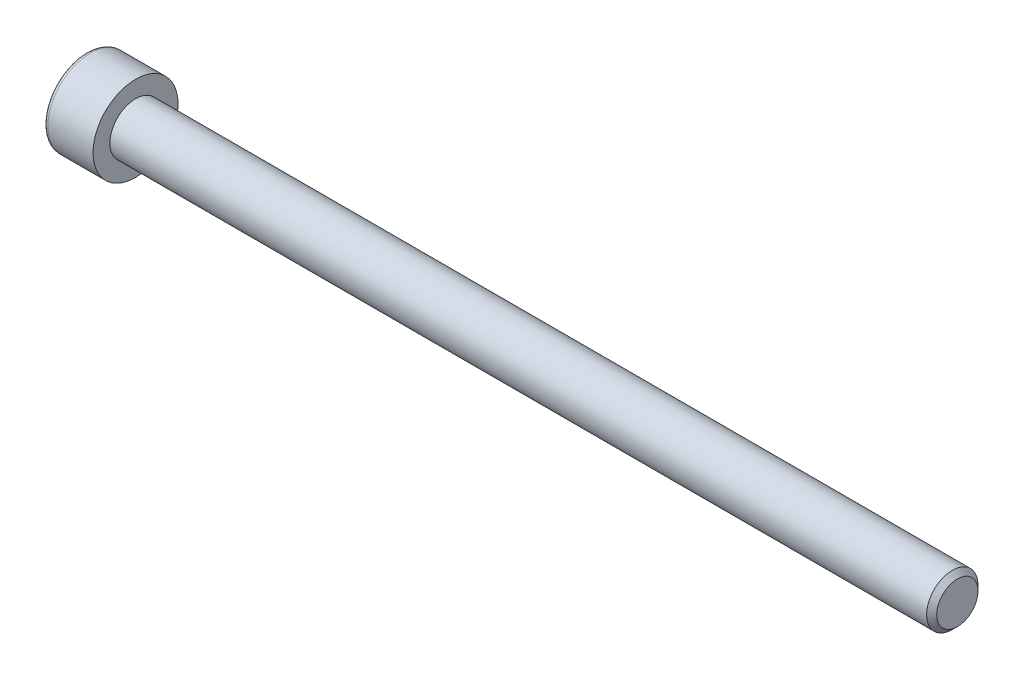
ISO-10303-21;
HEADER;
FILE_DESCRIPTION(('STEP AP214'),'2;1');
FILE_NAME('part.step','',(''),(''),'','','');
FILE_SCHEMA(('AUTOMOTIVE_DESIGN { 1 0 10303 214 1 1 1 1 }'));
ENDSEC;
DATA;
#1=APPLICATION_CONTEXT('core data for automotive mechanical design processes');
#2=APPLICATION_PROTOCOL_DEFINITION('international standard','automotive_design',2000,#1);
#3=PRODUCT_CONTEXT('',#1,'mechanical');
#4=PRODUCT('Part','Part','',(#3));
#5=PRODUCT_RELATED_PRODUCT_CATEGORY('part','',(#4));
#6=PRODUCT_DEFINITION_FORMATION('','',#4);
#7=PRODUCT_DEFINITION_CONTEXT('part definition',#1,'design');
#8=PRODUCT_DEFINITION('design','',#6,#7);
#9=PRODUCT_DEFINITION_SHAPE('','',#8);
#10=(LENGTH_UNIT() NAMED_UNIT(*) SI_UNIT(.MILLI.,.METRE.));
#11=(NAMED_UNIT(*) PLANE_ANGLE_UNIT() SI_UNIT($,.RADIAN.));
#12=(NAMED_UNIT(*) SI_UNIT($,.STERADIAN.) SOLID_ANGLE_UNIT());
#13=UNCERTAINTY_MEASURE_WITH_UNIT(LENGTH_MEASURE(1.E-05),#10,'distance_accuracy_value','');
#14=(GEOMETRIC_REPRESENTATION_CONTEXT(3) GLOBAL_UNCERTAINTY_ASSIGNED_CONTEXT((#13)) GLOBAL_UNIT_ASSIGNED_CONTEXT((#10,
#11,#12)) REPRESENTATION_CONTEXT('',''));
#15=CARTESIAN_POINT('',(0.,0.,0.));
#16=DIRECTION('',(0.,0.,1.));
#17=DIRECTION('',(1.,0.,0.));
#18=AXIS2_PLACEMENT_3D('',#15,#16,#17);
#19=CARTESIAN_POINT('',(0.,0.,0.));
#20=DIRECTION('',(-1.,0.,0.));
#21=DIRECTION('',(0.,0.,1.));
#22=AXIS2_PLACEMENT_3D('',#19,#20,#21);
#23=PLANE('',#22);
#24=CARTESIAN_POINT('',(0.,0.,0.));
#25=DIRECTION('',(-1.,0.,0.));
#26=DIRECTION('',(0.,0.,1.));
#27=AXIS2_PLACEMENT_3D('',#24,#25,#26);
#28=CIRCLE('',#27,4.14);
#29=CARTESIAN_POINT('',(0.,0.,4.14));
#30=VERTEX_POINT('',#29);
#31=EDGE_CURVE('E108',#30,#30,#28,.T.);
#32=ORIENTED_EDGE('',*,*,#31,.F.);
#33=EDGE_LOOP('',(#32));
#34=FACE_BOUND('',#33,.T.);
#35=CARTESIAN_POINT('',(0.,0.,0.));
#36=DIRECTION('',(-1.,0.,0.));
#37=DIRECTION('',(0.,0.,1.));
#38=AXIS2_PLACEMENT_3D('',#35,#36,#37);
#39=CIRCLE('',#38,2.5);
#40=CARTESIAN_POINT('',(0.,0.,2.5));
#41=VERTEX_POINT('',#40);
#42=EDGE_CURVE('E11',#41,#41,#39,.F.);
#43=ORIENTED_EDGE('',*,*,#42,.F.);
#44=EDGE_LOOP('',(#43));
#45=FACE_BOUND('',#44,.T.);
#46=ADVANCED_FACE('F16',(#34,#45),#23,.F.);
#47=CARTESIAN_POINT('',(-4.82,3.726,0.));
#48=DIRECTION('',(1.,0.,0.));
#49=DIRECTION('',(0.,0.,-1.));
#50=AXIS2_PLACEMENT_3D('',#47,#48,#49);
#51=PLANE('',#50);
#52=CARTESIAN_POINT('',(-4.82,0.,0.));
#53=DIRECTION('',(-1.,0.,0.));
#54=DIRECTION('',(0.,0.,1.));
#55=AXIS2_PLACEMENT_3D('',#52,#53,#54);
#56=CIRCLE('',#55,3.726);
#57=CARTESIAN_POINT('',(-4.82,0.,3.726));
#58=VERTEX_POINT('',#57);
#59=EDGE_CURVE('E91',#58,#58,#56,.T.);
#60=ORIENTED_EDGE('',*,*,#59,.T.);
#61=EDGE_LOOP('',(#60));
#62=FACE_BOUND('',#61,.T.);
#63=DIRECTION('',(0.,0.5,0.866025403784438));
#64=VECTOR('',#63,1.);
#65=CARTESIAN_POINT('',(-4.82,-0.800550807568874,2.61340532725041));
#66=LINE('',#65,#64);
#67=CARTESIAN_POINT('',(-4.82,-2.30940107675851,0.));
#68=VERTEX_POINT('',#67);
#69=CARTESIAN_POINT('',(-4.82,-1.15470053837925,2.));
#70=VERTEX_POINT('',#69);
#71=EDGE_CURVE('E25',#68,#70,#66,.T.);
#72=ORIENTED_EDGE('',*,*,#71,.F.);
#73=DIRECTION('',(0.,-0.5,0.866025403784439));
#74=VECTOR('',#73,1.);
#75=CARTESIAN_POINT('',(-4.82,-0.800550807568879,-2.61340532725041));
#76=LINE('',#75,#74);
#77=CARTESIAN_POINT('',(-4.82,-1.15470053837925,-2.));
#78=VERTEX_POINT('',#77);
#79=EDGE_CURVE('E40',#78,#68,#76,.T.);
#80=ORIENTED_EDGE('',*,*,#79,.F.);
#81=DIRECTION('',(0.,-1.,0.));
#82=VECTOR('',#81,1.);
#83=CARTESIAN_POINT('',(-4.82,3.726,-2.));
#84=LINE('',#83,#82);
#85=CARTESIAN_POINT('',(-4.82,1.15470053837925,-2.));
#86=VERTEX_POINT('',#85);
#87=EDGE_CURVE('E121',#86,#78,#84,.T.);
#88=ORIENTED_EDGE('',*,*,#87,.F.);
#89=DIRECTION('',(0.,-0.5,-0.866025403784439));
#90=VECTOR('',#89,1.);
#91=CARTESIAN_POINT('',(-4.82,2.66355080756888,0.613405327250409));
#92=LINE('',#91,#90);
#93=CARTESIAN_POINT('',(-4.82,2.30940107675851,0.));
#94=VERTEX_POINT('',#93);
#95=EDGE_CURVE('E118',#94,#86,#92,.T.);
#96=ORIENTED_EDGE('',*,*,#95,.F.);
#97=DIRECTION('',(0.,0.5,-0.866025403784439));
#98=VECTOR('',#97,1.);
#99=CARTESIAN_POINT('',(-4.82,2.66355080756888,-0.613405327250409));
#100=LINE('',#99,#98);
#101=CARTESIAN_POINT('',(-4.82,1.15470053837925,2.));
#102=VERTEX_POINT('',#101);
#103=EDGE_CURVE('E115',#102,#94,#100,.T.);
#104=ORIENTED_EDGE('',*,*,#103,.F.);
#105=DIRECTION('',(0.,1.,0.));
#106=VECTOR('',#105,1.);
#107=CARTESIAN_POINT('',(-4.82,3.726,2.));
#108=LINE('',#107,#106);
#109=EDGE_CURVE('E112',#70,#102,#108,.T.);
#110=ORIENTED_EDGE('',*,*,#109,.F.);
#111=EDGE_LOOP('',(#72,#80,#88,#96,#104,#110));
#112=FACE_BOUND('',#111,.T.);
#113=ADVANCED_FACE('F18',(#62,#112),#51,.F.);
#114=CARTESIAN_POINT('',(-4.82,0.,0.));
#115=DIRECTION('',(-1.,0.,0.));
#116=DIRECTION('',(0.,0.,1.));
#117=AXIS2_PLACEMENT_3D('',#114,#115,#116);
#118=CYLINDRICAL_SURFACE('',#117,4.14);
#119=CARTESIAN_POINT('',(-4.406,0.,0.));
#120=DIRECTION('',(-1.,0.,0.));
#121=DIRECTION('',(0.,0.,1.));
#122=AXIS2_PLACEMENT_3D('',#119,#120,#121);
#123=CIRCLE('',#122,4.14);
#124=CARTESIAN_POINT('',(-4.406,0.,4.14));
#125=VERTEX_POINT('',#124);
#126=EDGE_CURVE('E98',#125,#125,#123,.T.);
#127=ORIENTED_EDGE('',*,*,#126,.F.);
#128=EDGE_LOOP('',(#127));
#129=FACE_BOUND('',#128,.T.);
#130=ORIENTED_EDGE('',*,*,#31,.T.);
#131=EDGE_LOOP('',(#130));
#132=FACE_BOUND('',#131,.T.);
#133=ADVANCED_FACE('F202',(#129,#132),#118,.T.);
#134=CARTESIAN_POINT('',(-4.406,0.,0.));
#135=DIRECTION('',(-1.,0.,0.));
#136=DIRECTION('',(0.,0.,1.));
#137=AXIS2_PLACEMENT_3D('',#134,#135,#136);
#138=TOROIDAL_SURFACE('',#137,3.726,0.414);
#139=ORIENTED_EDGE('',*,*,#59,.F.);
#140=EDGE_LOOP('',(#139));
#141=FACE_BOUND('',#140,.T.);
#142=ORIENTED_EDGE('',*,*,#126,.T.);
#143=EDGE_LOOP('',(#142));
#144=FACE_BOUND('',#143,.T.);
#145=ADVANCED_FACE('F209',(#141,#144),#138,.T.);
#146=CARTESIAN_POINT('',(-2.32,-1.15470053837925,2.));
#147=DIRECTION('',(0.,0.866025403784438,-0.5));
#148=DIRECTION('',(0.,0.5,0.866025403784438));
#149=AXIS2_PLACEMENT_3D('',#146,#147,#148);
#150=PLANE('',#149);
#151=ORIENTED_EDGE('',*,*,#71,.T.);
#152=DIRECTION('',(-1.,0.,0.));
#153=VECTOR('',#152,1.);
#154=CARTESIAN_POINT('',(-2.32,-1.15470053837925,2.));
#155=LINE('',#154,#153);
#156=CARTESIAN_POINT('',(-2.32,-1.15470053837925,2.));
#157=VERTEX_POINT('',#156);
#158=EDGE_CURVE('E32',#157,#70,#155,.T.);
#159=ORIENTED_EDGE('',*,*,#158,.F.);
#160=DIRECTION('',(0.,-0.5,-0.866025403784439));
#161=VECTOR('',#160,1.);
#162=CARTESIAN_POINT('',(-2.32,-1.15470053837925,2.));
#163=LINE('',#162,#161);
#164=CARTESIAN_POINT('',(-2.32,-2.30940107675851,0.));
#165=VERTEX_POINT('',#164);
#166=EDGE_CURVE('E76',#157,#165,#163,.T.);
#167=ORIENTED_EDGE('',*,*,#166,.T.);
#168=DIRECTION('',(-1.,0.,0.));
#169=VECTOR('',#168,1.);
#170=CARTESIAN_POINT('',(-2.32,-2.30940107675851,0.));
#171=LINE('',#170,#169);
#172=EDGE_CURVE('E84',#165,#68,#171,.T.);
#173=ORIENTED_EDGE('',*,*,#172,.T.);
#174=EDGE_LOOP('',(#151,#159,#167,#173));
#175=FACE_BOUND('',#174,.T.);
#176=ADVANCED_FACE('F83',(#175),#150,.T.);
#177=CARTESIAN_POINT('',(-2.32,-2.30940107675851,0.));
#178=DIRECTION('',(0.,0.866025403784439,0.5));
#179=DIRECTION('',(0.,-0.5,0.866025403784439));
#180=AXIS2_PLACEMENT_3D('',#177,#178,#179);
#181=PLANE('',#180);
#182=ORIENTED_EDGE('',*,*,#79,.T.);
#183=ORIENTED_EDGE('',*,*,#172,.F.);
#184=DIRECTION('',(0.,0.5,-0.866025403784439));
#185=VECTOR('',#184,1.);
#186=CARTESIAN_POINT('',(-2.32,-2.30940107675851,0.));
#187=LINE('',#186,#185);
#188=CARTESIAN_POINT('',(-2.32,-1.15470053837925,-2.));
#189=VERTEX_POINT('',#188);
#190=EDGE_CURVE('E72',#165,#189,#187,.T.);
#191=ORIENTED_EDGE('',*,*,#190,.T.);
#192=DIRECTION('',(-1.,0.,0.));
#193=VECTOR('',#192,1.);
#194=CARTESIAN_POINT('',(-2.32,-1.15470053837925,-2.));
#195=LINE('',#194,#193);
#196=EDGE_CURVE('E92',#189,#78,#195,.T.);
#197=ORIENTED_EDGE('',*,*,#196,.T.);
#198=EDGE_LOOP('',(#182,#183,#191,#197));
#199=FACE_BOUND('',#198,.T.);
#200=ADVANCED_FACE('F89',(#199),#181,.T.);
#201=CARTESIAN_POINT('',(-2.32,-1.15470053837925,-2.));
#202=DIRECTION('',(0.,0.,1.));
#203=DIRECTION('',(0.,-1.,0.));
#204=AXIS2_PLACEMENT_3D('',#201,#202,#203);
#205=PLANE('',#204);
#206=ORIENTED_EDGE('',*,*,#87,.T.);
#207=ORIENTED_EDGE('',*,*,#196,.F.);
#208=DIRECTION('',(0.,1.,0.));
#209=VECTOR('',#208,1.);
#210=CARTESIAN_POINT('',(-2.32,-1.15470053837925,-2.));
#211=LINE('',#210,#209);
#212=CARTESIAN_POINT('',(-2.32,1.15470053837925,-2.));
#213=VERTEX_POINT('',#212);
#214=EDGE_CURVE('E78',#189,#213,#211,.T.);
#215=ORIENTED_EDGE('',*,*,#214,.T.);
#216=DIRECTION('',(-1.,0.,0.));
#217=VECTOR('',#216,1.);
#218=CARTESIAN_POINT('',(-2.32,1.15470053837925,-2.));
#219=LINE('',#218,#217);
#220=EDGE_CURVE('E101',#213,#86,#219,.T.);
#221=ORIENTED_EDGE('',*,*,#220,.T.);
#222=EDGE_LOOP('',(#206,#207,#215,#221));
#223=FACE_BOUND('',#222,.T.);
#224=ADVANCED_FACE('F160',(#223),#205,.T.);
#225=CARTESIAN_POINT('',(-2.32,1.15470053837925,-2.));
#226=DIRECTION('',(0.,-0.866025403784438,0.5));
#227=DIRECTION('',(0.,-0.5,-0.866025403784439));
#228=AXIS2_PLACEMENT_3D('',#225,#226,#227);
#229=PLANE('',#228);
#230=ORIENTED_EDGE('',*,*,#95,.T.);
#231=ORIENTED_EDGE('',*,*,#220,.F.);
#232=DIRECTION('',(0.,0.5,0.866025403784439));
#233=VECTOR('',#232,1.);
#234=CARTESIAN_POINT('',(-2.32,1.15470053837925,-2.));
#235=LINE('',#234,#233);
#236=CARTESIAN_POINT('',(-2.32,2.30940107675851,0.));
#237=VERTEX_POINT('',#236);
#238=EDGE_CURVE('E163',#213,#237,#235,.T.);
#239=ORIENTED_EDGE('',*,*,#238,.T.);
#240=DIRECTION('',(-1.,0.,0.));
#241=VECTOR('',#240,1.);
#242=CARTESIAN_POINT('',(-2.32,2.30940107675851,0.));
#243=LINE('',#242,#241);
#244=EDGE_CURVE('E142',#237,#94,#243,.T.);
#245=ORIENTED_EDGE('',*,*,#244,.T.);
#246=EDGE_LOOP('',(#230,#231,#239,#245));
#247=FACE_BOUND('',#246,.T.);
#248=ADVANCED_FACE('F162',(#247),#229,.T.);
#249=CARTESIAN_POINT('',(-2.32,2.30940107675851,0.));
#250=DIRECTION('',(0.,-0.866025403784439,-0.5));
#251=DIRECTION('',(0.,0.5,-0.866025403784439));
#252=AXIS2_PLACEMENT_3D('',#249,#250,#251);
#253=PLANE('',#252);
#254=ORIENTED_EDGE('',*,*,#103,.T.);
#255=ORIENTED_EDGE('',*,*,#244,.F.);
#256=DIRECTION('',(0.,-0.5,0.866025403784439));
#257=VECTOR('',#256,1.);
#258=CARTESIAN_POINT('',(-2.32,2.30940107675851,0.));
#259=LINE('',#258,#257);
#260=CARTESIAN_POINT('',(-2.32,1.15470053837925,2.));
#261=VERTEX_POINT('',#260);
#262=EDGE_CURVE('E140',#237,#261,#259,.T.);
#263=ORIENTED_EDGE('',*,*,#262,.T.);
#264=DIRECTION('',(-1.,0.,0.));
#265=VECTOR('',#264,1.);
#266=CARTESIAN_POINT('',(-2.32,1.15470053837925,2.));
#267=LINE('',#266,#265);
#268=EDGE_CURVE('E134',#261,#102,#267,.T.);
#269=ORIENTED_EDGE('',*,*,#268,.T.);
#270=EDGE_LOOP('',(#254,#255,#263,#269));
#271=FACE_BOUND('',#270,.T.);
#272=ADVANCED_FACE('F136',(#271),#253,.T.);
#273=CARTESIAN_POINT('',(-2.32,1.15470053837925,2.));
#274=DIRECTION('',(0.,0.,-1.));
#275=DIRECTION('',(0.,1.,0.));
#276=AXIS2_PLACEMENT_3D('',#273,#274,#275);
#277=PLANE('',#276);
#278=ORIENTED_EDGE('',*,*,#109,.T.);
#279=ORIENTED_EDGE('',*,*,#268,.F.);
#280=DIRECTION('',(0.,-1.,0.));
#281=VECTOR('',#280,1.);
#282=CARTESIAN_POINT('',(-2.32,1.15470053837925,2.));
#283=LINE('',#282,#281);
#284=EDGE_CURVE('E150',#261,#157,#283,.T.);
#285=ORIENTED_EDGE('',*,*,#284,.T.);
#286=ORIENTED_EDGE('',*,*,#158,.T.);
#287=EDGE_LOOP('',(#278,#279,#285,#286));
#288=FACE_BOUND('',#287,.T.);
#289=ADVANCED_FACE('F133',(#288),#277,.T.);
#290=CARTESIAN_POINT('',(-2.32,-2.30940107675851,0.));
#291=DIRECTION('',(1.,0.,0.));
#292=DIRECTION('',(0.,0.,1.));
#293=AXIS2_PLACEMENT_3D('',#290,#291,#292);
#294=PLANE('',#293);
#295=ORIENTED_EDGE('',*,*,#166,.F.);
#296=ORIENTED_EDGE('',*,*,#284,.F.);
#297=ORIENTED_EDGE('',*,*,#262,.F.);
#298=ORIENTED_EDGE('',*,*,#238,.F.);
#299=ORIENTED_EDGE('',*,*,#214,.F.);
#300=ORIENTED_EDGE('',*,*,#190,.F.);
#301=EDGE_LOOP('',(#295,#296,#297,#298,#299,#300));
#302=FACE_BOUND('',#301,.T.);
#303=ADVANCED_FACE('F74',(#302),#294,.F.);
#304=CARTESIAN_POINT('',(0.,0.,0.));
#305=DIRECTION('',(-1.,0.,0.));
#306=DIRECTION('',(0.,0.,1.));
#307=AXIS2_PLACEMENT_3D('',#304,#305,#306);
#308=CYLINDRICAL_SURFACE('',#307,2.5);
#309=CARTESIAN_POINT('',(79.5095,0.,0.));
#310=DIRECTION('',(-1.,0.,0.));
#311=DIRECTION('',(0.,0.,1.));
#312=AXIS2_PLACEMENT_3D('',#309,#310,#311);
#313=CIRCLE('',#312,2.5);
#314=CARTESIAN_POINT('',(79.5095,0.,2.5));
#315=VERTEX_POINT('',#314);
#316=EDGE_CURVE('E173',#315,#315,#313,.T.);
#317=ORIENTED_EDGE('',*,*,#316,.T.);
#318=EDGE_LOOP('',(#317));
#319=FACE_BOUND('',#318,.T.);
#320=ORIENTED_EDGE('',*,*,#42,.T.);
#321=EDGE_LOOP('',(#320));
#322=FACE_BOUND('',#321,.T.);
#323=ADVANCED_FACE('F179',(#319,#322),#308,.T.);
#324=CARTESIAN_POINT('',(80.,0.,0.));
#325=DIRECTION('',(-1.,0.,0.));
#326=DIRECTION('',(0.,0.,1.));
#327=AXIS2_PLACEMENT_3D('',#324,#325,#326);
#328=PLANE('',#327);
#329=CARTESIAN_POINT('',(80.,0.,0.));
#330=DIRECTION('',(-1.,0.,0.));
#331=DIRECTION('',(0.,0.,1.));
#332=AXIS2_PLACEMENT_3D('',#329,#330,#331);
#333=CIRCLE('',#332,2.0095);
#334=CARTESIAN_POINT('',(80.,0.,2.0095));
#335=VERTEX_POINT('',#334);
#336=EDGE_CURVE('E87',#335,#335,#333,.T.);
#337=ORIENTED_EDGE('',*,*,#336,.F.);
#338=EDGE_LOOP('',(#337));
#339=FACE_BOUND('',#338,.T.);
#340=ADVANCED_FACE('F185',(#339),#328,.F.);
#341=CARTESIAN_POINT('',(80.,0.,0.));
#342=DIRECTION('',(-1.,0.,0.));
#343=DIRECTION('',(0.,0.,1.));
#344=AXIS2_PLACEMENT_3D('',#341,#342,#343);
#345=CONICAL_SURFACE('',#344,2.0095,0.785398163397455);
#346=ORIENTED_EDGE('',*,*,#316,.F.);
#347=EDGE_LOOP('',(#346));
#348=FACE_BOUND('',#347,.T.);
#349=ORIENTED_EDGE('',*,*,#336,.T.);
#350=EDGE_LOOP('',(#349));
#351=FACE_BOUND('',#350,.T.);
#352=ADVANCED_FACE('F182',(#348,#351),#345,.T.);
#353=CLOSED_SHELL('',(#46,#113,#133,#145,#176,#200,#224,#248,#272,#289,#303,#323,#340,#352));
#354=MANIFOLD_SOLID_BREP('B1',#353);
#355=ADVANCED_BREP_SHAPE_REPRESENTATION('',(#18,#354),#14);
#356=SHAPE_DEFINITION_REPRESENTATION(#9,#355);
ENDSEC;
END-ISO-10303-21;
